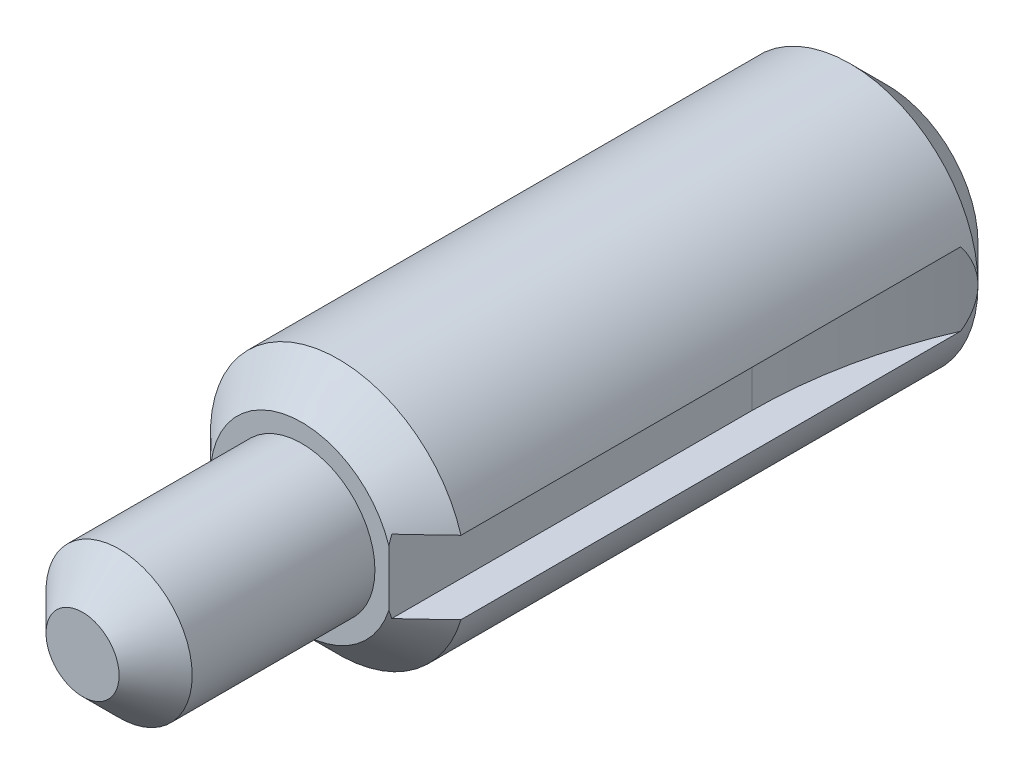
ISO-10303-21;
HEADER;
FILE_DESCRIPTION(('STEP AP214'),'2;1');
FILE_NAME('part.step','',(''),(''),'','','');
FILE_SCHEMA(('AUTOMOTIVE_DESIGN { 1 0 10303 214 1 1 1 1 }'));
ENDSEC;
DATA;
#1=APPLICATION_CONTEXT('core data for automotive mechanical design processes');
#2=APPLICATION_PROTOCOL_DEFINITION('international standard','automotive_design',2000,#1);
#3=PRODUCT_CONTEXT('',#1,'mechanical');
#4=PRODUCT('Part','Part','',(#3));
#5=PRODUCT_RELATED_PRODUCT_CATEGORY('part','',(#4));
#6=PRODUCT_DEFINITION_FORMATION('','',#4);
#7=PRODUCT_DEFINITION_CONTEXT('part definition',#1,'design');
#8=PRODUCT_DEFINITION('design','',#6,#7);
#9=PRODUCT_DEFINITION_SHAPE('','',#8);
#10=(LENGTH_UNIT() NAMED_UNIT(*) SI_UNIT(.MILLI.,.METRE.));
#11=(NAMED_UNIT(*) PLANE_ANGLE_UNIT() SI_UNIT($,.RADIAN.));
#12=(NAMED_UNIT(*) SI_UNIT($,.STERADIAN.) SOLID_ANGLE_UNIT());
#13=UNCERTAINTY_MEASURE_WITH_UNIT(LENGTH_MEASURE(1.E-05),#10,'distance_accuracy_value','');
#14=(GEOMETRIC_REPRESENTATION_CONTEXT(3) GLOBAL_UNCERTAINTY_ASSIGNED_CONTEXT((#13)) GLOBAL_UNIT_ASSIGNED_CONTEXT((#10,
#11,#12)) REPRESENTATION_CONTEXT('',''));
#15=CARTESIAN_POINT('',(0.,0.,0.));
#16=DIRECTION('',(0.,0.,1.));
#17=DIRECTION('',(1.,0.,0.));
#18=AXIS2_PLACEMENT_3D('',#15,#16,#17);
#19=CARTESIAN_POINT('',(0.,0.,25.4));
#20=DIRECTION('',(0.,0.,-1.));
#21=DIRECTION('',(-1.,0.,0.));
#22=AXIS2_PLACEMENT_3D('',#19,#20,#21);
#23=CYLINDRICAL_SURFACE('',#22,5.55625);
#24=CARTESIAN_POINT('',(0.,0.,1.5875));
#25=DIRECTION('',(0.,0.,1.));
#26=DIRECTION('',(1.,0.,0.));
#27=AXIS2_PLACEMENT_3D('',#24,#25,#26);
#28=CIRCLE('',#27,5.55625);
#29=CARTESIAN_POINT('',(5.55625,0.,1.5875));
#30=VERTEX_POINT('',#29);
#31=EDGE_CURVE('E157',#30,#30,#28,.T.);
#32=ORIENTED_EDGE('',*,*,#31,.T.);
#33=CARTESIAN_POINT('',(5.32463687142137,1.5875,2.10532103619973));
#34=CARTESIAN_POINT('',(5.34272999990055,1.52680476315139,2.06319623818861));
#35=CARTESIAN_POINT('',(5.36015972630349,1.46455764726736,2.02303941054666));
#36=CARTESIAN_POINT('',(5.3934065279323,1.33695428539947,1.94708351528751));
#37=CARTESIAN_POINT('',(5.40922178368362,1.27159465066331,1.91128935568729));
#38=CARTESIAN_POINT('',(5.4539344060008,1.07024967662489,1.81082218747389));
#39=CARTESIAN_POINT('',(5.47987502810003,0.929724701696795,1.75357926021883));
#40=CARTESIAN_POINT('',(5.52139502576498,0.638622830085893,1.6626800230602));
#41=CARTESIAN_POINT('',(5.53690347185519,0.487984630955416,1.62918509691455));
#42=CARTESIAN_POINT('',(5.55532240267939,0.182971758244705,1.589461625819));
#43=CARTESIAN_POINT('',(5.55828963708461,0.0286171017785372,1.58311025334037));
#44=CARTESIAN_POINT('',(5.55181791321221,-0.259891825380297,1.59703235009244));
#45=CARTESIAN_POINT('',(5.54382725427922,-0.394244138691934,1.61419739477278));
#46=CARTESIAN_POINT('',(5.51870849032359,-0.658352346662528,1.6686288577901));
#47=CARTESIAN_POINT('',(5.50155005781976,-0.78809145244374,1.70596199782298));
#48=CARTESIAN_POINT('',(5.46045055165253,-1.03460501661963,1.79654367972354));
#49=CARTESIAN_POINT('',(5.43680589957183,-1.15168972613475,1.84910129058389));
#50=CARTESIAN_POINT('',(5.38426137205452,-1.37658217090041,1.96772499255449));
#51=CARTESIAN_POINT('',(5.3553963867794,-1.48444488599681,2.03370174117438));
#52=CARTESIAN_POINT('',(5.32463687142137,-1.5875,2.10532103619973));
#53=B_SPLINE_CURVE_WITH_KNOTS('',3,(#33,#34,#35,#36,#37,#38,#39,#40,#41,#42,#43,#44,#45,#46,#47,
#48,#49,#50,#51,#52),.UNSPECIFIED.,.F.,.F.,(4,2,2,2,2,2,2,2,2,4),(0.,0.228113136515767,
0.456480577662464,0.915940682388199,1.3784939557359,1.83895189418439,2.24406492651124,
2.65052646763452,3.04084612140447,3.42864749077725),.UNSPECIFIED.);
#54=CARTESIAN_POINT('',(5.32463687142137,-1.5875,2.10532103619973));
#55=VERTEX_POINT('',#54);
#56=EDGE_CURVE('E112',#30,#55,#53,.T.);
#57=ORIENTED_EDGE('',*,*,#56,.T.);
#58=DIRECTION('',(0.,0.,-1.));
#59=VECTOR('',#58,1.);
#60=CARTESIAN_POINT('',(5.32463687142137,-1.5875,25.4));
#61=LINE('',#60,#59);
#62=CARTESIAN_POINT('',(5.32463687142137,-1.5875,23.8125));
#63=VERTEX_POINT('',#62);
#64=EDGE_CURVE('E94',#63,#55,#61,.T.);
#65=ORIENTED_EDGE('',*,*,#64,.F.);
#66=CARTESIAN_POINT('',(0.,0.,23.8125));
#67=DIRECTION('',(0.,0.,1.));
#68=DIRECTION('',(1.,0.,0.));
#69=AXIS2_PLACEMENT_3D('',#66,#67,#68);
#70=CIRCLE('',#69,5.55625);
#71=CARTESIAN_POINT('',(5.32463687142137,1.5875,23.8125));
#72=VERTEX_POINT('',#71);
#73=EDGE_CURVE('E159',#63,#72,#70,.F.);
#74=ORIENTED_EDGE('',*,*,#73,.T.);
#75=DIRECTION('',(0.,0.,-1.));
#76=VECTOR('',#75,1.);
#77=CARTESIAN_POINT('',(5.32463687142137,1.5875,25.4));
#78=LINE('',#77,#76);
#79=CARTESIAN_POINT('',(5.32463687142137,1.5875,2.10532103619973));
#80=VERTEX_POINT('',#79);
#81=EDGE_CURVE('E52',#72,#80,#78,.T.);
#82=ORIENTED_EDGE('',*,*,#81,.T.);
#83=EDGE_CURVE('E120',#80,#30,#53,.T.);
#84=ORIENTED_EDGE('',*,*,#83,.T.);
#85=EDGE_LOOP('',(#32,#57,#65,#74,#82,#84));
#86=FACE_BOUND('',#85,.T.);
#87=ADVANCED_FACE('F32',(#86),#23,.T.);
#88=CARTESIAN_POINT('',(0.,0.,25.4));
#89=DIRECTION('',(0.,0.,1.));
#90=DIRECTION('',(1.,0.,0.));
#91=AXIS2_PLACEMENT_3D('',#88,#89,#90);
#92=PLANE('',#91);
#93=DIRECTION('',(0.,1.,0.));
#94=VECTOR('',#93,1.);
#95=CARTESIAN_POINT('',(3.77825,-1.5875,25.4));
#96=LINE('',#95,#94);
#97=CARTESIAN_POINT('',(3.77825,-1.21482653082647,25.4));
#98=VERTEX_POINT('',#97);
#99=CARTESIAN_POINT('',(3.77825,1.21482653082647,25.4));
#100=VERTEX_POINT('',#99);
#101=EDGE_CURVE('E104',#98,#100,#96,.T.);
#102=ORIENTED_EDGE('',*,*,#101,.T.);
#103=CARTESIAN_POINT('',(0.,0.,25.4));
#104=DIRECTION('',(0.,0.,1.));
#105=DIRECTION('',(1.,0.,0.));
#106=AXIS2_PLACEMENT_3D('',#103,#104,#105);
#107=CIRCLE('',#106,3.96874999999999);
#108=EDGE_CURVE('E160',#100,#98,#107,.T.);
#109=ORIENTED_EDGE('',*,*,#108,.T.);
#110=EDGE_LOOP('',(#102,#109));
#111=FACE_BOUND('',#110,.T.);
#112=CARTESIAN_POINT('',(0.,0.,25.4));
#113=DIRECTION('',(0.,0.,1.));
#114=DIRECTION('',(1.,0.,0.));
#115=AXIS2_PLACEMENT_3D('',#112,#113,#114);
#116=CIRCLE('',#115,3.175);
#117=CARTESIAN_POINT('',(3.175,0.,25.4));
#118=VERTEX_POINT('',#117);
#119=EDGE_CURVE('E202',#118,#118,#116,.T.);
#120=ORIENTED_EDGE('',*,*,#119,.F.);
#121=EDGE_LOOP('',(#120));
#122=FACE_BOUND('',#121,.T.);
#123=ADVANCED_FACE('F142',(#111,#122),#92,.T.);
#124=CARTESIAN_POINT('',(0.,0.,0.));
#125=DIRECTION('',(0.,0.,1.));
#126=DIRECTION('',(1.,0.,0.));
#127=AXIS2_PLACEMENT_3D('',#124,#125,#126);
#128=PLANE('',#127);
#129=CARTESIAN_POINT('',(0.,0.,0.));
#130=DIRECTION('',(0.,0.,1.));
#131=DIRECTION('',(1.,0.,0.));
#132=AXIS2_PLACEMENT_3D('',#129,#130,#131);
#133=CIRCLE('',#132,3.96875);
#134=CARTESIAN_POINT('',(3.96875,0.,0.));
#135=VERTEX_POINT('',#134);
#136=EDGE_CURVE('E163',#135,#135,#133,.F.);
#137=ORIENTED_EDGE('',*,*,#136,.T.);
#138=EDGE_LOOP('',(#137));
#139=FACE_BOUND('',#138,.T.);
#140=ADVANCED_FACE('F140',(#139),#128,.F.);
#141=CARTESIAN_POINT('',(0.,0.,34.925));
#142=DIRECTION('',(0.,0.,-1.));
#143=DIRECTION('',(-1.,0.,0.));
#144=AXIS2_PLACEMENT_3D('',#141,#142,#143);
#145=CYLINDRICAL_SURFACE('',#144,3.175);
#146=CARTESIAN_POINT('',(0.,0.,33.3375));
#147=DIRECTION('',(0.,0.,1.));
#148=DIRECTION('',(1.,0.,0.));
#149=AXIS2_PLACEMENT_3D('',#146,#147,#148);
#150=CIRCLE('',#149,3.175);
#151=CARTESIAN_POINT('',(3.175,0.,33.3375));
#152=VERTEX_POINT('',#151);
#153=EDGE_CURVE('E166',#152,#152,#150,.F.);
#154=ORIENTED_EDGE('',*,*,#153,.T.);
#155=EDGE_LOOP('',(#154));
#156=FACE_BOUND('',#155,.T.);
#157=ORIENTED_EDGE('',*,*,#119,.T.);
#158=EDGE_LOOP('',(#157));
#159=FACE_BOUND('',#158,.T.);
#160=ADVANCED_FACE('F136',(#156,#159),#145,.T.);
#161=CARTESIAN_POINT('',(0.,0.,34.925));
#162=DIRECTION('',(0.,0.,1.));
#163=DIRECTION('',(1.,0.,0.));
#164=AXIS2_PLACEMENT_3D('',#161,#162,#163);
#165=PLANE('',#164);
#166=CARTESIAN_POINT('',(0.,0.,34.925));
#167=DIRECTION('',(0.,0.,1.));
#168=DIRECTION('',(1.,0.,0.));
#169=AXIS2_PLACEMENT_3D('',#166,#167,#168);
#170=CIRCLE('',#169,1.58750000000002);
#171=CARTESIAN_POINT('',(1.58750000000002,0.,34.925));
#172=VERTEX_POINT('',#171);
#173=EDGE_CURVE('E204',#172,#172,#170,.T.);
#174=ORIENTED_EDGE('',*,*,#173,.T.);
#175=EDGE_LOOP('',(#174));
#176=FACE_BOUND('',#175,.T.);
#177=ADVANCED_FACE('F132',(#176),#165,.T.);
#178=CARTESIAN_POINT('',(0.,0.,34.925));
#179=DIRECTION('',(0.,0.,-1.));
#180=DIRECTION('',(-1.,0.,0.));
#181=AXIS2_PLACEMENT_3D('',#178,#179,#180);
#182=CONICAL_SURFACE('',#181,1.58750000000002,0.785398163397446);
#183=ORIENTED_EDGE('',*,*,#153,.F.);
#184=EDGE_LOOP('',(#183));
#185=FACE_BOUND('',#184,.T.);
#186=ORIENTED_EDGE('',*,*,#173,.F.);
#187=EDGE_LOOP('',(#186));
#188=FACE_BOUND('',#187,.T.);
#189=ADVANCED_FACE('F135',(#185,#188),#182,.T.);
#190=CARTESIAN_POINT('',(0.,0.,25.4));
#191=DIRECTION('',(0.,0.,-1.));
#192=DIRECTION('',(-1.,0.,0.));
#193=AXIS2_PLACEMENT_3D('',#190,#191,#192);
#194=CONICAL_SURFACE('',#193,3.96874999999999,0.78539816339745);
#195=CARTESIAN_POINT('',(3.77825,3.71755474856855,24.0682418761401));
#196=CARTESIAN_POINT('',(3.77825,3.61229198278642,24.1420441967161));
#197=CARTESIAN_POINT('',(3.77825,3.5062909982475,24.2148186813206));
#198=CARTESIAN_POINT('',(3.77825,3.29251352321239,24.3578185510488));
#199=CARTESIAN_POINT('',(3.77825,3.1847362167384,24.4280427143557));
#200=CARTESIAN_POINT('',(3.77825,2.96581049190669,24.5662588235335));
#201=CARTESIAN_POINT('',(3.77825,2.8546365623156,24.6342105640564));
#202=CARTESIAN_POINT('',(3.77825,2.62998152489136,24.76617383151));
#203=CARTESIAN_POINT('',(3.77825,2.51650069416899,24.8301858280155));
#204=CARTESIAN_POINT('',(3.77825,2.28370778442299,24.95506940867));
#205=CARTESIAN_POINT('',(3.77825,2.16432135989838,25.0158033915877));
#206=CARTESIAN_POINT('',(3.77825,1.92244627655146,25.1308664993035));
#207=CARTESIAN_POINT('',(3.77825,1.79995704248903,25.1851944257468));
#208=CARTESIAN_POINT('',(3.77825,1.55233171481028,25.285593303576));
#209=CARTESIAN_POINT('',(3.77825,1.42721231871514,25.3317049773573));
#210=CARTESIAN_POINT('',(3.77825,1.17383524628274,25.4141656106618));
#211=CARTESIAN_POINT('',(3.77825,1.04557960946007,25.4505207398935));
#212=CARTESIAN_POINT('',(3.77825,0.79287086948194,25.5100550572573));
#213=CARTESIAN_POINT('',(3.77825,0.66855521896098,25.5338093932408));
#214=CARTESIAN_POINT('',(3.77825,0.418167881062189,25.5694480543697));
#215=CARTESIAN_POINT('',(3.77825,0.292095758295743,25.5813293814179));
#216=CARTESIAN_POINT('',(3.77825,0.0410793558948743,25.5923293351987));
#217=CARTESIAN_POINT('',(3.77825,-0.083857410557487,25.5916167865987));
#218=CARTESIAN_POINT('',(3.77825,-0.333041913346119,25.57789158444));
#219=CARTESIAN_POINT('',(3.77825,-0.45728964305156,25.564878812718));
#220=CARTESIAN_POINT('',(3.77825,-0.703069270225263,25.5275492821126));
#221=CARTESIAN_POINT('',(3.77825,-0.824614675792503,25.5033198064636));
#222=CARTESIAN_POINT('',(3.77825,-1.06533176613422,25.4449190102798));
#223=CARTESIAN_POINT('',(3.77825,-1.18450199685786,25.4107417882124));
#224=CARTESIAN_POINT('',(3.77825,-1.42150020404496,25.3335149635104));
#225=CARTESIAN_POINT('',(3.77825,-1.53929429432032,25.2903626341224));
#226=CARTESIAN_POINT('',(3.77825,-1.77198430040068,25.1969702051146));
#227=CARTESIAN_POINT('',(3.77825,-1.88688066044819,25.1467311998145));
#228=CARTESIAN_POINT('',(3.77825,-2.15370727355439,25.0218835114135));
#229=CARTESIAN_POINT('',(3.77825,-2.30452139351395,24.944900513502));
#230=CARTESIAN_POINT('',(3.77825,-2.60185963555866,24.7829786836672));
#231=CARTESIAN_POINT('',(3.77825,-2.74838143011733,24.6980356364927));
#232=CARTESIAN_POINT('',(3.77825,-3.03370080933905,24.5245730516269));
#233=CARTESIAN_POINT('',(3.77825,-3.17259984563876,24.4362194146592));
#234=CARTESIAN_POINT('',(3.77825,-3.3786431188032,24.3004417301007));
#235=CARTESIAN_POINT('',(3.77825,-3.44689056217219,24.2546762071797));
#236=CARTESIAN_POINT('',(3.77825,-3.58271122330814,24.1621652134774));
#237=CARTESIAN_POINT('',(3.77825,-3.65028448918613,24.1154198133717));
#238=CARTESIAN_POINT('',(3.77825,-3.71755474856855,24.0682418761401));
#239=B_SPLINE_CURVE_WITH_KNOTS('',3,(#195,#196,#197,#198,#199,#200,#201,#202,#203,#204,#205,
#206,#207,#208,#209,#210,#211,#212,#213,#214,#215,#216,#217,#218,#219,#220,#221,#222,#223,#224,
#225,#226,#227,#228,#229,#230,#231,#232,#233,#234,#235,#236,#237,#238),.UNSPECIFIED.,.F.,.F.,(4,
2,2,2,2,2,2,2,2,2,2,2,2,2,2,2,2,2,2,2,2,4),(0.,0.385687722914994,0.771557848261164,
1.16237930673183,1.55315409295491,1.95484058431932,2.35660209872145,2.7563133310596,
3.15577120074099,3.53495221444122,3.91422895235938,4.28842527483889,4.66262519210745,
5.03396097734951,5.4055175093297,5.78158718984626,6.15759886138299,6.6652422678075,
7.17315603293617,7.66689924094007,7.91340788439345,8.15989880868895),.UNSPECIFIED.);
#240=CARTESIAN_POINT('',(3.77825,-1.5875,25.2705394987568));
#241=VERTEX_POINT('',#240);
#242=EDGE_CURVE('E12',#98,#241,#239,.T.);
#243=ORIENTED_EDGE('',*,*,#242,.F.);
#244=ORIENTED_EDGE('',*,*,#108,.F.);
#245=CARTESIAN_POINT('',(3.77825,1.5875,25.2705394987568));
#246=VERTEX_POINT('',#245);
#247=EDGE_CURVE('E45',#246,#100,#239,.T.);
#248=ORIENTED_EDGE('',*,*,#247,.F.);
#249=CARTESIAN_POINT('',(7.7249085820219,1.5875,21.4824093498254));
#250=CARTESIAN_POINT('',(7.46314174175195,1.5875,21.7387791411839));
#251=CARTESIAN_POINT('',(7.20114635453801,1.5875,21.9949173645362));
#252=CARTESIAN_POINT('',(6.67648838235838,1.5875,22.5063833209858));
#253=CARTESIAN_POINT('',(6.41382597236978,1.5875,22.7617112336379));
#254=CARTESIAN_POINT('',(5.88779571454774,1.5875,23.2710447291731));
#255=CARTESIAN_POINT('',(5.62442899785067,1.5875,23.5250514794558));
#256=CARTESIAN_POINT('',(5.09615613179639,1.5875,24.0315911971927));
#257=CARTESIAN_POINT('',(4.83124962612296,1.5875,24.2841237940235));
#258=CARTESIAN_POINT('',(4.43186987160292,1.5875,24.6613365487043));
#259=CARTESIAN_POINT('',(4.29826773126348,1.5875,24.7869385442179));
#260=CARTESIAN_POINT('',(4.03030825788602,1.5875,25.0373239403141));
#261=CARTESIAN_POINT('',(3.89595095713297,1.5875,25.1621073754053));
#262=CARTESIAN_POINT('',(3.62632148771605,1.5875,25.410516156699));
#263=CARTESIAN_POINT('',(3.4910499327544,1.5875,25.5341421681541));
#264=CARTESIAN_POINT('',(3.21914045662928,1.5875,25.7799300488671));
#265=CARTESIAN_POINT('',(3.08250232366944,1.5875,25.9020916845134));
#266=CARTESIAN_POINT('',(2.807063246188,1.5875,26.1445483136941));
#267=CARTESIAN_POINT('',(2.66825834316373,1.5875,26.2648388197851));
#268=CARTESIAN_POINT('',(2.3880007564019,1.5875,26.5022021415671));
#269=CARTESIAN_POINT('',(2.2465492508852,1.5875,26.6192763343835));
#270=CARTESIAN_POINT('',(2.03113884014552,1.5875,26.7911867474136));
#271=CARTESIAN_POINT('',(1.95871068276538,1.5875,26.8479370259776));
#272=CARTESIAN_POINT('',(1.81257015678698,1.5875,26.9597369968071));
#273=CARTESIAN_POINT('',(1.73885802501178,1.5875,27.0147869975934));
#274=CARTESIAN_POINT('',(1.58968848391724,1.5875,27.1227296499246));
#275=CARTESIAN_POINT('',(1.51422862397489,1.5875,27.1756189437787));
#276=CARTESIAN_POINT('',(1.39946223758688,1.5875,27.252657130595));
#277=CARTESIAN_POINT('',(1.36093170144407,1.5875,27.2779614615689));
#278=CARTESIAN_POINT('',(1.28327691262778,1.5875,27.3276546829099));
#279=CARTESIAN_POINT('',(1.24415256694427,1.5875,27.3520434277441));
#280=CARTESIAN_POINT('',(1.20469963646445,1.5875,27.3758984089131));
#281=B_SPLINE_CURVE_WITH_KNOTS('',3,(#249,#250,#251,#252,#253,#254,#255,#256,#257,#258,#259,
#260,#261,#262,#263,#264,#265,#266,#267,#268,#269,#270,#271,#272,#273,#274,#275,#276,#277,#278,
#279,#280),.UNSPECIFIED.,.F.,.F.,(4,2,2,2,2,2,2,2,2,2,2,2,2,2,2,4),(0.,1.09919522979344,
2.19812698727751,3.29581813818308,4.39377430639329,4.94388872151321,5.49397979412418,
6.04373243789922,6.59357164664794,7.14457215917101,7.69533295245941,7.97135392508902,
8.24732451500451,8.52370879989566,8.66198753780783,8.8002881629224),.UNSPECIFIED.);
#282=EDGE_CURVE('E171',#72,#246,#281,.T.);
#283=ORIENTED_EDGE('',*,*,#282,.F.);
#284=ORIENTED_EDGE('',*,*,#73,.F.);
#285=CARTESIAN_POINT('',(7.7249085820219,-1.5875,21.4824093498254));
#286=CARTESIAN_POINT('',(7.46314174175195,-1.5875,21.7387791411839));
#287=CARTESIAN_POINT('',(7.20114635453801,-1.5875,21.9949173645362));
#288=CARTESIAN_POINT('',(6.67648838235838,-1.5875,22.5063833209858));
#289=CARTESIAN_POINT('',(6.41382597236978,-1.5875,22.7617112336379));
#290=CARTESIAN_POINT('',(5.88779571454774,-1.5875,23.2710447291731));
#291=CARTESIAN_POINT('',(5.62442899785067,-1.5875,23.5250514794558));
#292=CARTESIAN_POINT('',(5.09615613179639,-1.5875,24.0315911971927));
#293=CARTESIAN_POINT('',(4.83124962612296,-1.5875,24.2841237940235));
#294=CARTESIAN_POINT('',(4.43186987160292,-1.5875,24.6613365487043));
#295=CARTESIAN_POINT('',(4.29826773126348,-1.5875,24.7869385442179));
#296=CARTESIAN_POINT('',(4.03030825788602,-1.5875,25.0373239403141));
#297=CARTESIAN_POINT('',(3.89595095713297,-1.5875,25.1621073754053));
#298=CARTESIAN_POINT('',(3.62632148771605,-1.5875,25.410516156699));
#299=CARTESIAN_POINT('',(3.4910499327544,-1.5875,25.5341421681541));
#300=CARTESIAN_POINT('',(3.21914045662928,-1.5875,25.7799300488671));
#301=CARTESIAN_POINT('',(3.08250232366944,-1.5875,25.9020916845134));
#302=CARTESIAN_POINT('',(2.807063246188,-1.5875,26.1445483136941));
#303=CARTESIAN_POINT('',(2.66825834316373,-1.5875,26.2648388197851));
#304=CARTESIAN_POINT('',(2.3880007564019,-1.5875,26.5022021415671));
#305=CARTESIAN_POINT('',(2.2465492508852,-1.5875,26.6192763343835));
#306=CARTESIAN_POINT('',(2.03113884014552,-1.5875,26.7911867474136));
#307=CARTESIAN_POINT('',(1.95871068276538,-1.5875,26.8479370259776));
#308=CARTESIAN_POINT('',(1.81257015678698,-1.5875,26.9597369968071));
#309=CARTESIAN_POINT('',(1.73885802501178,-1.5875,27.0147869975934));
#310=CARTESIAN_POINT('',(1.58968848391724,-1.5875,27.1227296499246));
#311=CARTESIAN_POINT('',(1.51422862397489,-1.5875,27.1756189437787));
#312=CARTESIAN_POINT('',(1.39946223758688,-1.5875,27.252657130595));
#313=CARTESIAN_POINT('',(1.36093170144407,-1.5875,27.2779614615689));
#314=CARTESIAN_POINT('',(1.28327691262778,-1.5875,27.3276546829099));
#315=CARTESIAN_POINT('',(1.24415256694427,-1.5875,27.3520434277441));
#316=CARTESIAN_POINT('',(1.20469963646445,-1.5875,27.3758984089131));
#317=B_SPLINE_CURVE_WITH_KNOTS('',3,(#285,#286,#287,#288,#289,#290,#291,#292,#293,#294,#295,
#296,#297,#298,#299,#300,#301,#302,#303,#304,#305,#306,#307,#308,#309,#310,#311,#312,#313,#314,
#315,#316),.UNSPECIFIED.,.F.,.F.,(4,2,2,2,2,2,2,2,2,2,2,2,2,2,2,4),(0.,1.09919522979344,
2.19812698727751,3.29581813818308,4.39377430639329,4.94388872151321,5.49397979412418,
6.04373243789922,6.59357164664794,7.14457215917101,7.69533295245941,7.97135392508902,
8.24732451500451,8.52370879989566,8.66198753780783,8.8002881629224),.UNSPECIFIED.);
#318=EDGE_CURVE('E36',#63,#241,#317,.T.);
#319=ORIENTED_EDGE('',*,*,#318,.T.);
#320=EDGE_LOOP('',(#243,#244,#248,#283,#284,#319));
#321=FACE_BOUND('',#320,.T.);
#322=ADVANCED_FACE('F178',(#321),#194,.T.);
#323=CARTESIAN_POINT('',(0.,0.,1.5875));
#324=DIRECTION('',(0.,0.,1.));
#325=DIRECTION('',(1.,0.,0.));
#326=AXIS2_PLACEMENT_3D('',#323,#324,#325);
#327=CONICAL_SURFACE('',#326,5.55625,0.785398163397449);
#328=ORIENTED_EDGE('',*,*,#136,.F.);
#329=EDGE_LOOP('',(#328));
#330=FACE_BOUND('',#329,.T.);
#331=ORIENTED_EDGE('',*,*,#31,.F.);
#332=EDGE_LOOP('',(#331));
#333=FACE_BOUND('',#332,.T.);
#334=ADVANCED_FACE('F34',(#330,#333),#327,.T.);
#335=CARTESIAN_POINT('',(22.82825,-1.5875,9.62370034593464));
#336=DIRECTION('',(0.,1.,0.));
#337=DIRECTION('',(0.,0.,1.));
#338=AXIS2_PLACEMENT_3D('',#335,#336,#337);
#339=PLANE('',#338);
#340=ORIENTED_EDGE('',*,*,#64,.T.);
#341=CARTESIAN_POINT('',(22.82825,-1.5875,9.62370034593464));
#342=DIRECTION('',(0.,1.,0.));
#343=DIRECTION('',(0.,0.,1.));
#344=AXIS2_PLACEMENT_3D('',#341,#342,#343);
#345=CIRCLE('',#344,19.05);
#346=CARTESIAN_POINT('',(3.77825,-1.5875,9.62370034593464));
#347=VERTEX_POINT('',#346);
#348=EDGE_CURVE('E87',#55,#347,#345,.T.);
#349=ORIENTED_EDGE('',*,*,#348,.T.);
#350=DIRECTION('',(0.,0.,1.));
#351=VECTOR('',#350,1.);
#352=CARTESIAN_POINT('',(3.77825,-1.5875,9.62370034593464));
#353=LINE('',#352,#351);
#354=EDGE_CURVE('E91',#347,#241,#353,.T.);
#355=ORIENTED_EDGE('',*,*,#354,.T.);
#356=ORIENTED_EDGE('',*,*,#318,.F.);
#357=EDGE_LOOP('',(#340,#349,#355,#356));
#358=FACE_BOUND('',#357,.T.);
#359=ADVANCED_FACE('F89',(#358),#339,.T.);
#360=CARTESIAN_POINT('',(22.82825,1.5875,9.62370034593464));
#361=DIRECTION('',(0.,1.,0.));
#362=DIRECTION('',(0.,0.,1.));
#363=AXIS2_PLACEMENT_3D('',#360,#361,#362);
#364=PLANE('',#363);
#365=ORIENTED_EDGE('',*,*,#282,.T.);
#366=DIRECTION('',(0.,0.,1.));
#367=VECTOR('',#366,1.);
#368=CARTESIAN_POINT('',(3.77825,1.5875,9.62370034593464));
#369=LINE('',#368,#367);
#370=CARTESIAN_POINT('',(3.77825,1.5875,9.62370034593464));
#371=VERTEX_POINT('',#370);
#372=EDGE_CURVE('E97',#371,#246,#369,.T.);
#373=ORIENTED_EDGE('',*,*,#372,.F.);
#374=CARTESIAN_POINT('',(22.82825,1.5875,9.62370034593464));
#375=DIRECTION('',(0.,1.,0.));
#376=DIRECTION('',(0.,0.,1.));
#377=AXIS2_PLACEMENT_3D('',#374,#375,#376);
#378=CIRCLE('',#377,19.05);
#379=EDGE_CURVE('E102',#80,#371,#378,.T.);
#380=ORIENTED_EDGE('',*,*,#379,.F.);
#381=ORIENTED_EDGE('',*,*,#81,.F.);
#382=EDGE_LOOP('',(#365,#373,#380,#381));
#383=FACE_BOUND('',#382,.T.);
#384=ADVANCED_FACE('F129',(#383),#364,.F.);
#385=CARTESIAN_POINT('',(22.82825,-1.5875,9.62370034593464));
#386=DIRECTION('',(0.,1.,0.));
#387=DIRECTION('',(0.,0.,1.));
#388=AXIS2_PLACEMENT_3D('',#385,#386,#387);
#389=CYLINDRICAL_SURFACE('',#388,19.05);
#390=ORIENTED_EDGE('',*,*,#379,.T.);
#391=DIRECTION('',(0.,1.,0.));
#392=VECTOR('',#391,1.);
#393=CARTESIAN_POINT('',(3.77825,-1.5875,9.62370034593464));
#394=LINE('',#393,#392);
#395=EDGE_CURVE('E100',#347,#371,#394,.T.);
#396=ORIENTED_EDGE('',*,*,#395,.F.);
#397=ORIENTED_EDGE('',*,*,#348,.F.);
#398=ORIENTED_EDGE('',*,*,#56,.F.);
#399=ORIENTED_EDGE('',*,*,#83,.F.);
#400=EDGE_LOOP('',(#390,#396,#397,#398,#399));
#401=FACE_BOUND('',#400,.T.);
#402=ADVANCED_FACE('F101',(#401),#389,.F.);
#403=CARTESIAN_POINT('',(3.77825,-1.5875,9.62370034593464));
#404=DIRECTION('',(-1.,0.,0.));
#405=DIRECTION('',(0.,0.,1.));
#406=AXIS2_PLACEMENT_3D('',#403,#404,#405);
#407=PLANE('',#406);
#408=ORIENTED_EDGE('',*,*,#247,.T.);
#409=ORIENTED_EDGE('',*,*,#101,.F.);
#410=ORIENTED_EDGE('',*,*,#242,.T.);
#411=ORIENTED_EDGE('',*,*,#354,.F.);
#412=ORIENTED_EDGE('',*,*,#395,.T.);
#413=ORIENTED_EDGE('',*,*,#372,.T.);
#414=EDGE_LOOP('',(#408,#409,#410,#411,#412,#413));
#415=FACE_BOUND('',#414,.T.);
#416=ADVANCED_FACE('F106',(#415),#407,.F.);
#417=CLOSED_SHELL('',(#87,#123,#140,#160,#177,#189,#322,#334,#359,#384,#402,#416));
#418=MANIFOLD_SOLID_BREP('B2',#417);
#419=ADVANCED_BREP_SHAPE_REPRESENTATION('',(#18,#418),#14);
#420=SHAPE_DEFINITION_REPRESENTATION(#9,#419);
ENDSEC;
END-ISO-10303-21;
